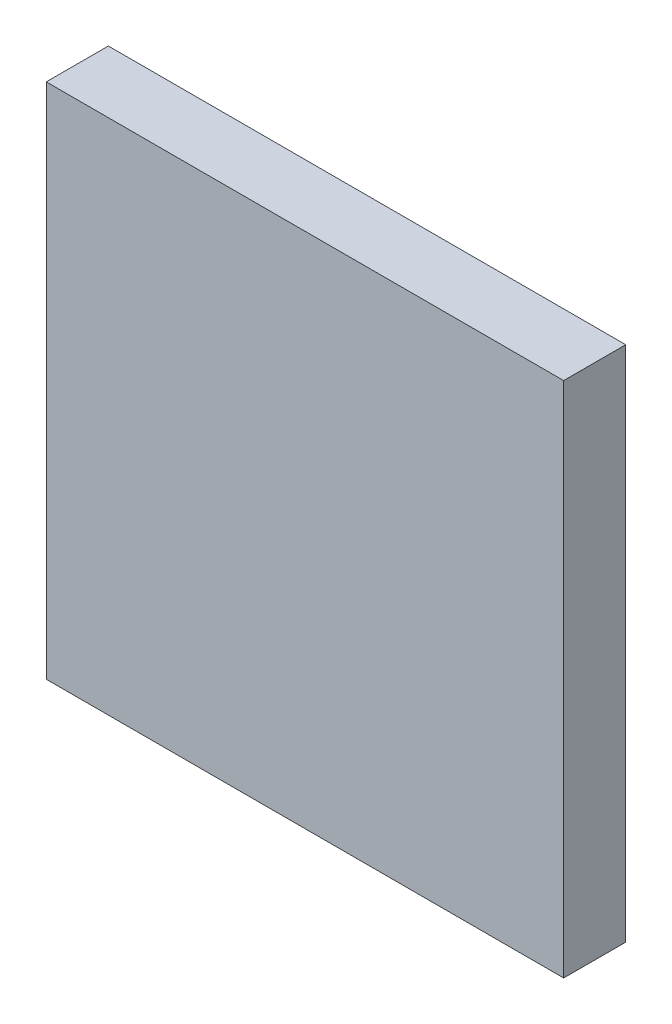
ISO-10303-21;
HEADER;
FILE_DESCRIPTION(('STEP AP214'),'2;1');
FILE_NAME('part.step','',(''),(''),'','','');
FILE_SCHEMA(('AUTOMOTIVE_DESIGN { 1 0 10303 214 1 1 1 1 }'));
ENDSEC;
DATA;
#1=APPLICATION_CONTEXT('core data for automotive mechanical design processes');
#2=APPLICATION_PROTOCOL_DEFINITION('international standard','automotive_design',2000,#1);
#3=PRODUCT_CONTEXT('',#1,'mechanical');
#4=PRODUCT('Part','Part','',(#3));
#5=PRODUCT_RELATED_PRODUCT_CATEGORY('part','',(#4));
#6=PRODUCT_DEFINITION_FORMATION('','',#4);
#7=PRODUCT_DEFINITION_CONTEXT('part definition',#1,'design');
#8=PRODUCT_DEFINITION('design','',#6,#7);
#9=PRODUCT_DEFINITION_SHAPE('','',#8);
#10=(LENGTH_UNIT() NAMED_UNIT(*) SI_UNIT(.MILLI.,.METRE.));
#11=(NAMED_UNIT(*) PLANE_ANGLE_UNIT() SI_UNIT($,.RADIAN.));
#12=(NAMED_UNIT(*) SI_UNIT($,.STERADIAN.) SOLID_ANGLE_UNIT());
#13=UNCERTAINTY_MEASURE_WITH_UNIT(LENGTH_MEASURE(1.E-05),#10,'distance_accuracy_value','');
#14=(GEOMETRIC_REPRESENTATION_CONTEXT(3) GLOBAL_UNCERTAINTY_ASSIGNED_CONTEXT((#13)) GLOBAL_UNIT_ASSIGNED_CONTEXT((#10,
#11,#12)) REPRESENTATION_CONTEXT('',''));
#15=CARTESIAN_POINT('',(0.,0.,0.));
#16=DIRECTION('',(0.,0.,1.));
#17=DIRECTION('',(1.,0.,0.));
#18=AXIS2_PLACEMENT_3D('',#15,#16,#17);
#19=CARTESIAN_POINT('',(-5.00000016,-5.00000016,0.));
#20=DIRECTION('',(0.,1.,0.));
#21=DIRECTION('',(1.,0.,0.));
#22=AXIS2_PLACEMENT_3D('',#19,#20,#21);
#23=PLANE('',#22);
#24=DIRECTION('',(1.,0.,0.));
#25=VECTOR('',#24,1.);
#26=CARTESIAN_POINT('',(-5.00000016,-5.00000016,0.));
#27=LINE('',#26,#25);
#28=CARTESIAN_POINT('',(-5.00000016,-5.00000016,0.));
#29=VERTEX_POINT('',#28);
#30=CARTESIAN_POINT('',(5.00000016,-5.00000016,0.));
#31=VERTEX_POINT('',#30);
#32=EDGE_CURVE('E10',#29,#31,#27,.T.);
#33=ORIENTED_EDGE('',*,*,#32,.T.);
#34=DIRECTION('',(0.,0.,1.));
#35=VECTOR('',#34,1.);
#36=CARTESIAN_POINT('',(5.00000016,-5.00000016,0.));
#37=LINE('',#36,#35);
#38=CARTESIAN_POINT('',(5.00000016,-5.00000016,1.20000014));
#39=VERTEX_POINT('',#38);
#40=EDGE_CURVE('E23',#31,#39,#37,.T.);
#41=ORIENTED_EDGE('',*,*,#40,.T.);
#42=DIRECTION('',(1.,0.,0.));
#43=VECTOR('',#42,1.);
#44=CARTESIAN_POINT('',(-5.00000016,-5.00000016,1.20000014));
#45=LINE('',#44,#43);
#46=CARTESIAN_POINT('',(-5.00000016,-5.00000016,1.20000014));
#47=VERTEX_POINT('',#46);
#48=EDGE_CURVE('E86',#47,#39,#45,.T.);
#49=ORIENTED_EDGE('',*,*,#48,.F.);
#50=DIRECTION('',(0.,0.,1.));
#51=VECTOR('',#50,1.);
#52=CARTESIAN_POINT('',(-5.00000016,-5.00000016,0.));
#53=LINE('',#52,#51);
#54=EDGE_CURVE('E37',#29,#47,#53,.T.);
#55=ORIENTED_EDGE('',*,*,#54,.F.);
#56=EDGE_LOOP('',(#33,#41,#49,#55));
#57=FACE_BOUND('',#56,.T.);
#58=ADVANCED_FACE('F16',(#57),#23,.F.);
#59=CARTESIAN_POINT('',(5.00000016,-5.00000016,0.));
#60=DIRECTION('',(-1.,0.,0.));
#61=DIRECTION('',(0.,1.,0.));
#62=AXIS2_PLACEMENT_3D('',#59,#60,#61);
#63=PLANE('',#62);
#64=DIRECTION('',(0.,1.,0.));
#65=VECTOR('',#64,1.);
#66=CARTESIAN_POINT('',(5.00000016,-5.00000016,0.));
#67=LINE('',#66,#65);
#68=CARTESIAN_POINT('',(5.00000016,5.00000016,0.));
#69=VERTEX_POINT('',#68);
#70=EDGE_CURVE('E30',#31,#69,#67,.T.);
#71=ORIENTED_EDGE('',*,*,#70,.T.);
#72=DIRECTION('',(0.,0.,1.));
#73=VECTOR('',#72,1.);
#74=CARTESIAN_POINT('',(5.00000016,5.00000016,0.));
#75=LINE('',#74,#73);
#76=CARTESIAN_POINT('',(5.00000016,5.00000016,1.20000014));
#77=VERTEX_POINT('',#76);
#78=EDGE_CURVE('E82',#69,#77,#75,.T.);
#79=ORIENTED_EDGE('',*,*,#78,.T.);
#80=DIRECTION('',(0.,1.,0.));
#81=VECTOR('',#80,1.);
#82=CARTESIAN_POINT('',(5.00000016,-5.00000016,1.20000014));
#83=LINE('',#82,#81);
#84=EDGE_CURVE('E62',#39,#77,#83,.T.);
#85=ORIENTED_EDGE('',*,*,#84,.F.);
#86=ORIENTED_EDGE('',*,*,#40,.F.);
#87=EDGE_LOOP('',(#71,#79,#85,#86));
#88=FACE_BOUND('',#87,.T.);
#89=ADVANCED_FACE('F89',(#88),#63,.F.);
#90=CARTESIAN_POINT('',(5.00000016,5.00000016,0.));
#91=DIRECTION('',(0.,-1.,0.));
#92=DIRECTION('',(-1.,0.,0.));
#93=AXIS2_PLACEMENT_3D('',#90,#91,#92);
#94=PLANE('',#93);
#95=DIRECTION('',(-1.,0.,0.));
#96=VECTOR('',#95,1.);
#97=CARTESIAN_POINT('',(5.00000016,5.00000016,0.));
#98=LINE('',#97,#96);
#99=CARTESIAN_POINT('',(-5.00000016,5.00000016,0.));
#100=VERTEX_POINT('',#99);
#101=EDGE_CURVE('E71',#69,#100,#98,.T.);
#102=ORIENTED_EDGE('',*,*,#101,.T.);
#103=DIRECTION('',(0.,0.,1.));
#104=VECTOR('',#103,1.);
#105=CARTESIAN_POINT('',(-5.00000016,5.00000016,0.));
#106=LINE('',#105,#104);
#107=CARTESIAN_POINT('',(-5.00000016,5.00000016,1.20000014));
#108=VERTEX_POINT('',#107);
#109=EDGE_CURVE('E66',#100,#108,#106,.T.);
#110=ORIENTED_EDGE('',*,*,#109,.T.);
#111=DIRECTION('',(-1.,0.,0.));
#112=VECTOR('',#111,1.);
#113=CARTESIAN_POINT('',(5.00000016,5.00000016,1.20000014));
#114=LINE('',#113,#112);
#115=EDGE_CURVE('E56',#77,#108,#114,.T.);
#116=ORIENTED_EDGE('',*,*,#115,.F.);
#117=ORIENTED_EDGE('',*,*,#78,.F.);
#118=EDGE_LOOP('',(#102,#110,#116,#117));
#119=FACE_BOUND('',#118,.T.);
#120=ADVANCED_FACE('F70',(#119),#94,.F.);
#121=CARTESIAN_POINT('',(-5.00000016,5.00000016,0.));
#122=DIRECTION('',(1.,0.,0.));
#123=DIRECTION('',(0.,-1.,0.));
#124=AXIS2_PLACEMENT_3D('',#121,#122,#123);
#125=PLANE('',#124);
#126=DIRECTION('',(0.,-1.,0.));
#127=VECTOR('',#126,1.);
#128=CARTESIAN_POINT('',(-5.00000016,5.00000016,0.));
#129=LINE('',#128,#127);
#130=EDGE_CURVE('E67',#100,#29,#129,.T.);
#131=ORIENTED_EDGE('',*,*,#130,.T.);
#132=ORIENTED_EDGE('',*,*,#54,.T.);
#133=DIRECTION('',(0.,-1.,0.));
#134=VECTOR('',#133,1.);
#135=CARTESIAN_POINT('',(-5.00000016,5.00000016,1.20000014));
#136=LINE('',#135,#134);
#137=EDGE_CURVE('E60',#108,#47,#136,.T.);
#138=ORIENTED_EDGE('',*,*,#137,.F.);
#139=ORIENTED_EDGE('',*,*,#109,.F.);
#140=EDGE_LOOP('',(#131,#132,#138,#139));
#141=FACE_BOUND('',#140,.T.);
#142=ADVANCED_FACE('F76',(#141),#125,.F.);
#143=CARTESIAN_POINT('',(0.,0.,0.));
#144=DIRECTION('',(0.,0.,1.));
#145=DIRECTION('',(1.,0.,0.));
#146=AXIS2_PLACEMENT_3D('',#143,#144,#145);
#147=PLANE('',#146);
#148=ORIENTED_EDGE('',*,*,#130,.F.);
#149=ORIENTED_EDGE('',*,*,#101,.F.);
#150=ORIENTED_EDGE('',*,*,#70,.F.);
#151=ORIENTED_EDGE('',*,*,#32,.F.);
#152=EDGE_LOOP('',(#148,#149,#150,#151));
#153=FACE_BOUND('',#152,.T.);
#154=ADVANCED_FACE('F90',(#153),#147,.F.);
#155=CARTESIAN_POINT('',(0.,0.,1.20000014));
#156=DIRECTION('',(0.,0.,1.));
#157=DIRECTION('',(1.,0.,0.));
#158=AXIS2_PLACEMENT_3D('',#155,#156,#157);
#159=PLANE('',#158);
#160=ORIENTED_EDGE('',*,*,#48,.T.);
#161=ORIENTED_EDGE('',*,*,#84,.T.);
#162=ORIENTED_EDGE('',*,*,#115,.T.);
#163=ORIENTED_EDGE('',*,*,#137,.T.);
#164=EDGE_LOOP('',(#160,#161,#162,#163));
#165=FACE_BOUND('',#164,.T.);
#166=ADVANCED_FACE('F58',(#165),#159,.T.);
#167=CLOSED_SHELL('',(#58,#89,#120,#142,#154,#166));
#168=MANIFOLD_SOLID_BREP('B1',#167);
#169=ADVANCED_BREP_SHAPE_REPRESENTATION('',(#18,#168),#14);
#170=SHAPE_DEFINITION_REPRESENTATION(#9,#169);
ENDSEC;
END-ISO-10303-21;
